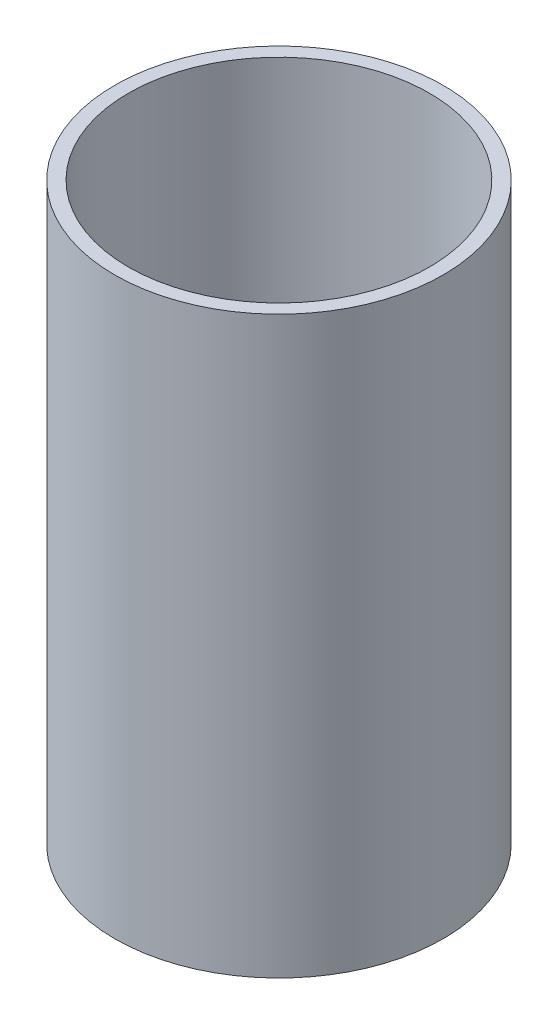
ISO-10303-21;
HEADER;
FILE_DESCRIPTION(('STEP AP214'),'2;1');
FILE_NAME('part.step','',(''),(''),'','','');
FILE_SCHEMA(('AUTOMOTIVE_DESIGN { 1 0 10303 214 1 1 1 1 }'));
ENDSEC;
DATA;
#1=APPLICATION_CONTEXT('core data for automotive mechanical design processes');
#2=APPLICATION_PROTOCOL_DEFINITION('international standard','automotive_design',2000,#1);
#3=PRODUCT_CONTEXT('',#1,'mechanical');
#4=PRODUCT('Part','Part','',(#3));
#5=PRODUCT_RELATED_PRODUCT_CATEGORY('part','',(#4));
#6=PRODUCT_DEFINITION_FORMATION('','',#4);
#7=PRODUCT_DEFINITION_CONTEXT('part definition',#1,'design');
#8=PRODUCT_DEFINITION('design','',#6,#7);
#9=PRODUCT_DEFINITION_SHAPE('','',#8);
#10=(LENGTH_UNIT() NAMED_UNIT(*) SI_UNIT(.MILLI.,.METRE.));
#11=(NAMED_UNIT(*) PLANE_ANGLE_UNIT() SI_UNIT($,.RADIAN.));
#12=(NAMED_UNIT(*) SI_UNIT($,.STERADIAN.) SOLID_ANGLE_UNIT());
#13=UNCERTAINTY_MEASURE_WITH_UNIT(LENGTH_MEASURE(1.E-05),#10,'distance_accuracy_value','');
#14=(GEOMETRIC_REPRESENTATION_CONTEXT(3) GLOBAL_UNCERTAINTY_ASSIGNED_CONTEXT((#13)) GLOBAL_UNIT_ASSIGNED_CONTEXT((#10,
#11,#12)) REPRESENTATION_CONTEXT('',''));
#15=CARTESIAN_POINT('',(0.,0.,0.));
#16=DIRECTION('',(0.,0.,1.));
#17=DIRECTION('',(1.,0.,0.));
#18=AXIS2_PLACEMENT_3D('',#15,#16,#17);
#19=CARTESIAN_POINT('',(0.,21.,0.));
#20=DIRECTION('',(0.,1.,0.));
#21=DIRECTION('',(0.,0.,1.));
#22=AXIS2_PLACEMENT_3D('',#19,#20,#21);
#23=PLANE('',#22);
#24=CARTESIAN_POINT('',(0.,21.,0.));
#25=DIRECTION('',(0.,1.,0.));
#26=DIRECTION('',(0.,0.,1.));
#27=AXIS2_PLACEMENT_3D('',#24,#25,#26);
#28=CIRCLE('',#27,12.);
#29=CARTESIAN_POINT('',(0.,21.,12.));
#30=VERTEX_POINT('',#29);
#31=EDGE_CURVE('E10',#30,#30,#28,.T.);
#32=ORIENTED_EDGE('',*,*,#31,.T.);
#33=EDGE_LOOP('',(#32));
#34=FACE_BOUND('',#33,.T.);
#35=CARTESIAN_POINT('',(0.,21.,0.));
#36=DIRECTION('',(0.,1.,0.));
#37=DIRECTION('',(0.,0.,1.));
#38=AXIS2_PLACEMENT_3D('',#35,#36,#37);
#39=CIRCLE('',#38,11.);
#40=CARTESIAN_POINT('',(0.,21.,11.));
#41=VERTEX_POINT('',#40);
#42=EDGE_CURVE('E45',#41,#41,#39,.T.);
#43=ORIENTED_EDGE('',*,*,#42,.F.);
#44=EDGE_LOOP('',(#43));
#45=FACE_BOUND('',#44,.T.);
#46=ADVANCED_FACE('F34',(#34,#45),#23,.T.);
#47=CARTESIAN_POINT('',(0.,-21.,0.));
#48=DIRECTION('',(0.,1.,0.));
#49=DIRECTION('',(0.,0.,1.));
#50=AXIS2_PLACEMENT_3D('',#47,#48,#49);
#51=PLANE('',#50);
#52=CARTESIAN_POINT('',(0.,-21.,0.));
#53=DIRECTION('',(0.,1.,0.));
#54=DIRECTION('',(0.,0.,1.));
#55=AXIS2_PLACEMENT_3D('',#52,#53,#54);
#56=CIRCLE('',#55,12.);
#57=CARTESIAN_POINT('',(0.,-21.,12.));
#58=VERTEX_POINT('',#57);
#59=EDGE_CURVE('E38',#58,#58,#56,.T.);
#60=ORIENTED_EDGE('',*,*,#59,.F.);
#61=EDGE_LOOP('',(#60));
#62=FACE_BOUND('',#61,.T.);
#63=CARTESIAN_POINT('',(0.,-21.,0.));
#64=DIRECTION('',(0.,1.,0.));
#65=DIRECTION('',(0.,0.,1.));
#66=AXIS2_PLACEMENT_3D('',#63,#64,#65);
#67=CIRCLE('',#66,11.);
#68=CARTESIAN_POINT('',(0.,-21.,11.));
#69=VERTEX_POINT('',#68);
#70=EDGE_CURVE('E47',#69,#69,#67,.T.);
#71=ORIENTED_EDGE('',*,*,#70,.T.);
#72=EDGE_LOOP('',(#71));
#73=FACE_BOUND('',#72,.T.);
#74=ADVANCED_FACE('F57',(#62,#73),#51,.F.);
#75=CARTESIAN_POINT('',(0.,21.,0.));
#76=DIRECTION('',(0.,-1.,0.));
#77=DIRECTION('',(0.,0.,-1.));
#78=AXIS2_PLACEMENT_3D('',#75,#76,#77);
#79=CYLINDRICAL_SURFACE('',#78,12.);
#80=ORIENTED_EDGE('',*,*,#31,.F.);
#81=EDGE_LOOP('',(#80));
#82=FACE_BOUND('',#81,.T.);
#83=ORIENTED_EDGE('',*,*,#59,.T.);
#84=EDGE_LOOP('',(#83));
#85=FACE_BOUND('',#84,.T.);
#86=ADVANCED_FACE('F36',(#82,#85),#79,.T.);
#87=CARTESIAN_POINT('',(0.,21.,0.));
#88=DIRECTION('',(0.,-1.,0.));
#89=DIRECTION('',(0.,0.,-1.));
#90=AXIS2_PLACEMENT_3D('',#87,#88,#89);
#91=CYLINDRICAL_SURFACE('',#90,11.);
#92=ORIENTED_EDGE('',*,*,#42,.T.);
#93=EDGE_LOOP('',(#92));
#94=FACE_BOUND('',#93,.T.);
#95=ORIENTED_EDGE('',*,*,#70,.F.);
#96=EDGE_LOOP('',(#95));
#97=FACE_BOUND('',#96,.T.);
#98=ADVANCED_FACE('F53',(#94,#97),#91,.F.);
#99=CLOSED_SHELL('',(#46,#74,#86,#98));
#100=MANIFOLD_SOLID_BREP('B2',#99);
#101=ADVANCED_BREP_SHAPE_REPRESENTATION('',(#18,#100),#14);
#102=SHAPE_DEFINITION_REPRESENTATION(#9,#101);
ENDSEC;
END-ISO-10303-21;
